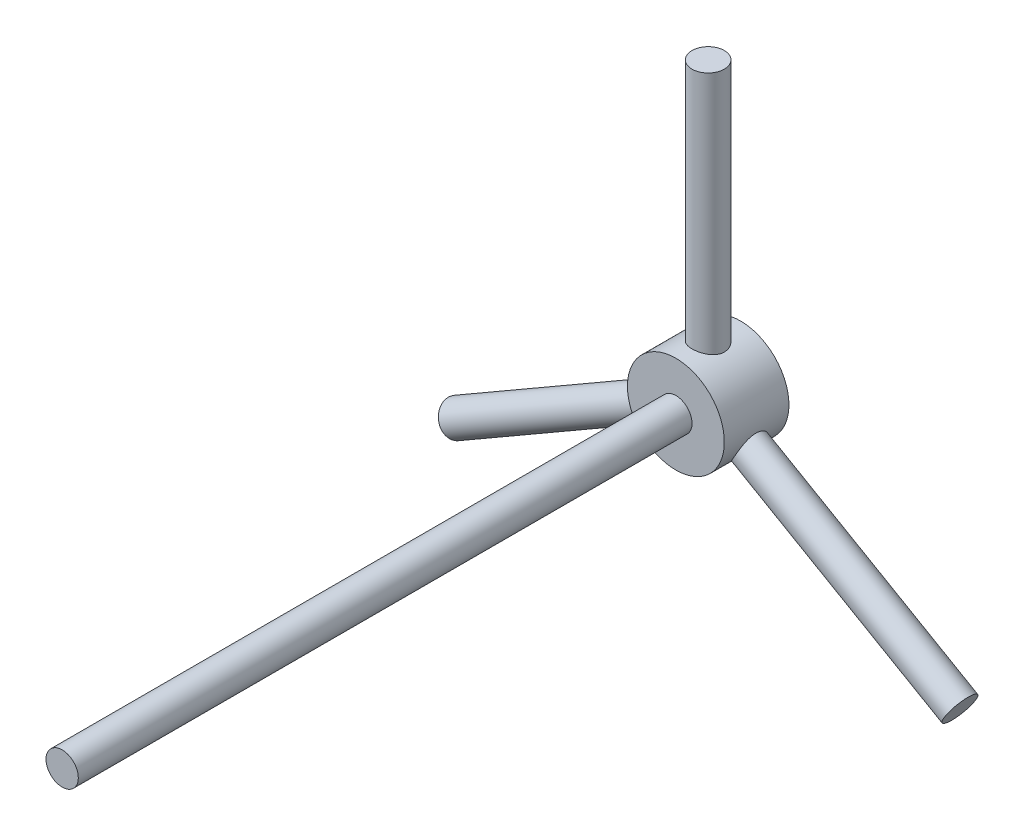
ISO-10303-21;
HEADER;
FILE_DESCRIPTION(('STEP AP214'),'2;1');
FILE_NAME('part.step','',(''),(''),'','','');
FILE_SCHEMA(('AUTOMOTIVE_DESIGN { 1 0 10303 214 1 1 1 1 }'));
ENDSEC;
DATA;
#1=APPLICATION_CONTEXT('core data for automotive mechanical design processes');
#2=APPLICATION_PROTOCOL_DEFINITION('international standard','automotive_design',2000,#1);
#3=PRODUCT_CONTEXT('',#1,'mechanical');
#4=PRODUCT('Part','Part','',(#3));
#5=PRODUCT_RELATED_PRODUCT_CATEGORY('part','',(#4));
#6=PRODUCT_DEFINITION_FORMATION('','',#4);
#7=PRODUCT_DEFINITION_CONTEXT('part definition',#1,'design');
#8=PRODUCT_DEFINITION('design','',#6,#7);
#9=PRODUCT_DEFINITION_SHAPE('','',#8);
#10=(LENGTH_UNIT() NAMED_UNIT(*) SI_UNIT(.MILLI.,.METRE.));
#11=(NAMED_UNIT(*) PLANE_ANGLE_UNIT() SI_UNIT($,.RADIAN.));
#12=(NAMED_UNIT(*) SI_UNIT($,.STERADIAN.) SOLID_ANGLE_UNIT());
#13=UNCERTAINTY_MEASURE_WITH_UNIT(LENGTH_MEASURE(1.E-05),#10,'distance_accuracy_value','');
#14=(GEOMETRIC_REPRESENTATION_CONTEXT(3) GLOBAL_UNCERTAINTY_ASSIGNED_CONTEXT((#13)) GLOBAL_UNIT_ASSIGNED_CONTEXT((#10,
#11,#12)) REPRESENTATION_CONTEXT('',''));
#15=CARTESIAN_POINT('',(0.,0.,0.));
#16=DIRECTION('',(0.,0.,1.));
#17=DIRECTION('',(1.,0.,0.));
#18=AXIS2_PLACEMENT_3D('',#15,#16,#17);
#19=CARTESIAN_POINT('',(0.,0.,-140.));
#20=DIRECTION('',(0.,0.,1.));
#21=DIRECTION('',(1.,0.,0.));
#22=AXIS2_PLACEMENT_3D('',#19,#20,#21);
#23=CYLINDRICAL_SURFACE('',#22,15.);
#24=CARTESIAN_POINT('',(0.,0.,-140.));
#25=DIRECTION('',(0.,0.,-1.));
#26=DIRECTION('',(-1.,0.,0.));
#27=AXIS2_PLACEMENT_3D('',#24,#25,#26);
#28=CIRCLE('',#27,15.);
#29=CARTESIAN_POINT('',(-15.,0.,-140.));
#30=VERTEX_POINT('',#29);
#31=EDGE_CURVE('E106',#30,#30,#28,.T.);
#32=ORIENTED_EDGE('',*,*,#31,.F.);
#33=EDGE_LOOP('',(#32));
#34=FACE_BOUND('',#33,.T.);
#35=CARTESIAN_POINT('',(0.,0.,-120.));
#36=DIRECTION('',(0.,0.,-1.));
#37=DIRECTION('',(-1.,0.,0.));
#38=AXIS2_PLACEMENT_3D('',#35,#36,#37);
#39=CIRCLE('',#38,15.);
#40=CARTESIAN_POINT('',(-15.,0.,-120.));
#41=VERTEX_POINT('',#40);
#42=EDGE_CURVE('E110',#41,#41,#39,.T.);
#43=ORIENTED_EDGE('',*,*,#42,.T.);
#44=EDGE_LOOP('',(#43));
#45=FACE_BOUND('',#44,.T.);
#46=CARTESIAN_POINT('',(0.,15.,-135.));
#47=CARTESIAN_POINT('',(-0.272816814433607,15.0000007650471,-135.000001268658));
#48=CARTESIAN_POINT('',(-0.545625972692718,14.9924884753769,-134.977598669364));
#49=CARTESIAN_POINT('',(-1.08320880436489,14.9632605101644,-134.888854455914));
#50=CARTESIAN_POINT('',(-1.3479816405942,14.941543360109,-134.822508280255));
#51=CARTESIAN_POINT('',(-1.86166394750877,14.8862653953208,-134.64840378308));
#52=CARTESIAN_POINT('',(-2.11059912942975,14.8527243865377,-134.540714687704));
#53=CARTESIAN_POINT('',(-2.58687468402703,14.7772222858721,-134.287294135808));
#54=CARTESIAN_POINT('',(-2.81421078479507,14.7352595334076,-134.141555174985));
#55=CARTESIAN_POINT('',(-3.24870837510974,14.6457047221309,-133.810870975708));
#56=CARTESIAN_POINT('',(-3.45501850148552,14.5979778231161,-133.624843828706));
#57=CARTESIAN_POINT('',(-3.83416346351645,14.5030157392292,-133.221164226459));
#58=CARTESIAN_POINT('',(-4.00699092746984,14.4557806648007,-133.003504825327));
#59=CARTESIAN_POINT('',(-4.319124711119,14.3656666235818,-132.535074424045));
#60=CARTESIAN_POINT('',(-4.45732429102253,14.3229519627198,-132.283531301449));
#61=CARTESIAN_POINT('',(-4.68909436930559,14.2487652698844,-131.759119527821));
#62=CARTESIAN_POINT('',(-4.78267848691248,14.2172898077928,-131.486257414221));
#63=CARTESIAN_POINT('',(-4.91936730756489,14.1705651637056,-130.936633892489));
#64=CARTESIAN_POINT('',(-4.96406724136037,14.1548047884338,-130.66031395754));
#65=CARTESIAN_POINT('',(-5.00670561667087,14.1397828315221,-130.103681229235));
#66=CARTESIAN_POINT('',(-5.00465850803659,14.1405161515599,-129.823369696484));
#67=CARTESIAN_POINT('',(-4.95509951850357,14.1579507500054,-129.280316847739));
#68=CARTESIAN_POINT('',(-4.90966956578089,14.1739207918415,-129.017357985281));
#69=CARTESIAN_POINT('',(-4.77803081419367,14.2188328846856,-128.503032901849));
#70=CARTESIAN_POINT('',(-4.69181713294739,14.2477764887883,-128.251668072798));
#71=CARTESIAN_POINT('',(-4.47969529031769,14.3158955569848,-127.76293625208));
#72=CARTESIAN_POINT('',(-4.35317024354078,14.3552282897692,-127.525859872662));
#73=CARTESIAN_POINT('',(-4.06444553151123,14.4396279286729,-127.075645458591));
#74=CARTESIAN_POINT('',(-3.90223556181879,14.4846964894921,-126.86251436533));
#75=CARTESIAN_POINT('',(-3.53674666341246,14.5783664584198,-126.454542009199));
#76=CARTESIAN_POINT('',(-3.3317657503819,14.6270294677509,-126.261236527455));
#77=CARTESIAN_POINT('',(-2.89169784984997,14.7203469193431,-125.911343666682));
#78=CARTESIAN_POINT('',(-2.65660797830397,14.765000976901,-125.754759809177));
#79=CARTESIAN_POINT('',(-2.15973806523143,14.8458553968921,-125.481518498825));
#80=CARTESIAN_POINT('',(-1.8977163820817,14.8819675004026,-125.365272543296));
#81=CARTESIAN_POINT('',(-1.35634541682251,14.9410283572211,-125.178984130221));
#82=CARTESIAN_POINT('',(-1.07700219077476,14.9639816827438,-125.108925622883));
#83=CARTESIAN_POINT('',(-0.521919147646528,14.9933813535722,-125.019721669888));
#84=CARTESIAN_POINT('',(-0.246547999324234,15.0005000916864,-124.998500954136));
#85=CARTESIAN_POINT('',(0.303875349801189,14.9994451347413,-125.001663367992));
#86=CARTESIAN_POINT('',(0.578927596598254,14.9912740209681,-125.026038799899));
#87=CARTESIAN_POINT('',(1.11259933152128,14.9610012358552,-125.11805953868));
#88=CARTESIAN_POINT('',(1.37146403417422,14.9393099355596,-125.184431030247));
#89=CARTESIAN_POINT('',(1.87427979289787,14.8845923415035,-125.356967222334));
#90=CARTESIAN_POINT('',(2.11822894254304,14.8515646023338,-125.463136997339));
#91=CARTESIAN_POINT('',(2.59144148196637,14.7764465643645,-125.715352159204));
#92=CARTESIAN_POINT('',(2.82014979608573,14.7341407377893,-125.862372966416));
#93=CARTESIAN_POINT('',(3.25032415067792,14.6452626958131,-126.190970750067));
#94=CARTESIAN_POINT('',(3.45178183897788,14.5986891796914,-126.372558280159));
#95=CARTESIAN_POINT('',(3.8312625390315,14.5038423990222,-126.774893755033));
#96=CARTESIAN_POINT('',(4.00780484622885,14.4555880543714,-126.997046134634));
#97=CARTESIAN_POINT('',(4.32128761161786,14.3649986647354,-127.468857839054));
#98=CARTESIAN_POINT('',(4.45822773965506,14.3226636691001,-127.71851739317));
#99=CARTESIAN_POINT('',(4.6879846520818,14.2491195895692,-128.238365076449));
#100=CARTESIAN_POINT('',(4.7808906608251,14.2178880396489,-128.508510395844));
#101=CARTESIAN_POINT('',(4.91947333379678,14.1705416153225,-129.061893250221));
#102=CARTESIAN_POINT('',(4.9651712747697,14.154419931182,-129.345124827022));
#103=CARTESIAN_POINT('',(5.00638141238671,14.1398929437089,-129.900985480205));
#104=CARTESIAN_POINT('',(5.004351286542,14.1406200128708,-130.173411701434));
#105=CARTESIAN_POINT('',(4.95621146724347,14.1575634911934,-130.71382537461));
#106=CARTESIAN_POINT('',(4.91010439729293,14.1737789784681,-130.981813089775));
#107=CARTESIAN_POINT('',(4.77685906564673,14.2192262152446,-131.500678315012));
#108=CARTESIAN_POINT('',(4.69051673007757,14.2482049011239,-131.751784125022));
#109=CARTESIAN_POINT('',(4.47989682879873,14.3158199409234,-132.236137034691));
#110=CARTESIAN_POINT('',(4.35561084276902,14.3544584381697,-132.46938015594));
#111=CARTESIAN_POINT('',(4.06630346291715,14.4391414613023,-132.922418349615));
#112=CARTESIAN_POINT('',(3.8997412138229,14.4854355821069,-133.141182509492));
#113=CARTESIAN_POINT('',(3.53321441567824,14.5791678141626,-133.548449066921));
#114=CARTESIAN_POINT('',(3.33324042225741,14.6266062456186,-133.73694287844));
#115=CARTESIAN_POINT('',(2.89620778460345,14.7195015262772,-134.085722061446));
#116=CARTESIAN_POINT('',(2.65800756749865,14.7648090900628,-134.244621738755));
#117=CARTESIAN_POINT('',(2.15678678703313,14.8462995586306,-134.519952144253));
#118=CARTESIAN_POINT('',(1.89377259066174,14.8824847953965,-134.63639372961));
#119=CARTESIAN_POINT('',(1.36246823600487,14.9402757534271,-134.818608162443));
#120=CARTESIAN_POINT('',(1.09493878838204,14.9624606211261,-134.886412331317));
#121=CARTESIAN_POINT('',(0.551602080051229,14.9923203532111,-134.977101403386));
#122=CARTESIAN_POINT('',(0.275797127843722,14.9999992265954,-134.999998717483));
#123=CARTESIAN_POINT('',(0.,15.,-135.));
#124=B_SPLINE_CURVE_WITH_KNOTS('',3,(#46,#47,#48,#49,#50,#51,#52,#53,#54,#55,#56,#57,#58,#59,
#60,#61,#62,#63,#64,#65,#66,#67,#68,#69,#70,#71,#72,#73,#74,#75,#76,#77,#78,#79,#80,#81,#82,#83,
#84,#85,#86,#87,#88,#89,#90,#91,#92,#93,#94,#95,#96,#97,#98,#99,#100,#101,#102,#103,#104,#105,
#106,#107,#108,#109,#110,#111,#112,#113,#114,#115,#116,#117,#118,#119,#120,#121,#122,#123),
.UNSPECIFIED.,.T.,.F.,(4,2,2,2,2,2,2,2,2,2,2,2,2,2,2,2,2,2,2,2,2,2,2,2,2,2,2,2,2,2,2,2,2,2,2,2,
2,2,4),(0.,0.817435530130051,1.63495592633761,2.45111336435137,3.26743188899549,
4.10923421413779,4.95122166437652,5.81741924118925,6.6833522346775,7.52009628712783,
8.35658169941008,9.15484132763714,9.95319654288063,10.764408557863,11.5758551280169,
12.4296652906749,13.2835572984374,14.1459202826244,15.0079834439669,15.832679158865,
16.6572356583153,17.4579078990172,18.2586822643117,19.0805199922933,19.9026090412011,
20.7620511441441,21.6215004118563,22.479200691445,23.3365142353985,24.1497833033194,
24.9630039676753,25.7607793541274,26.5587319089054,27.3915033346968,28.2245105562954,
29.0899830418615,29.9552340577293,30.7818279187972,31.6081933020135),.UNSPECIFIED.);
#125=CARTESIAN_POINT('',(0.,15.,-135.));
#126=VERTEX_POINT('',#125);
#127=EDGE_CURVE('E54',#126,#126,#124,.T.);
#128=ORIENTED_EDGE('',*,*,#127,.F.);
#129=EDGE_LOOP('',(#128));
#130=FACE_BOUND('',#129,.T.);
#131=CARTESIAN_POINT('',(9.74744871391585,-11.4011948307877,-130.));
#132=CARTESIAN_POINT('',(9.74744729204055,-11.4011954991294,-130.27234087418));
#133=CARTESIAN_POINT('',(9.76549911687741,-11.385836297385,-130.544673999118));
#134=CARTESIAN_POINT('',(9.836373376482,-11.3246589578408,-131.081272104971));
#135=CARTESIAN_POINT('',(9.88920153881731,-11.2788358026989,-131.345535749362));
#136=CARTESIAN_POINT('',(10.0258547993025,-11.157530467179,-131.858134464986));
#137=CARTESIAN_POINT('',(10.1096191370544,-11.0821064065834,-132.106499647214));
#138=CARTESIAN_POINT('',(10.3030570648259,-10.9024938914726,-132.58180024274));
#139=CARTESIAN_POINT('',(10.4127363708872,-10.7982990901642,-132.808730912768));
#140=CARTESIAN_POINT('',(10.6564300763415,-10.5579706212188,-133.243599811692));
#141=CARTESIAN_POINT('',(10.7911704668704,-10.4208339627081,-133.450577143359));
#142=CARTESIAN_POINT('',(11.0754033609003,-10.1182251447018,-133.831034006123));
#143=CARTESIAN_POINT('',(11.2248982275841,-9.95274844293069,-134.004508157912));
#144=CARTESIAN_POINT('',(11.5357747803679,-9.59083866791103,-134.317394486648));
#145=CARTESIAN_POINT('',(11.6973648391181,-9.39371055413828,-134.45579985309));
#146=CARTESIAN_POINT('',(12.0213835274724,-8.9753116302445,-134.687957925638));
#147=CARTESIAN_POINT('',(12.1838119191314,-8.75404734650128,-134.781722665885));
#148=CARTESIAN_POINT('',(12.4968862923078,-8.3006655485025,-134.918679273162));
#149=CARTESIAN_POINT('',(12.6477455912463,-8.0691935125121,-134.963517231285));
#150=CARTESIAN_POINT('',(12.9380246609471,-7.59504475948524,-135.006581466803));
#151=CARTESIAN_POINT('',(13.0774473709283,-7.35237094653363,-135.004819758262));
#152=CARTESIAN_POINT('',(13.3354109868568,-6.87299459282486,-134.95577872717));
#153=CARTESIAN_POINT('',(13.4545564251917,-6.63643115377736,-134.910287357628));
#154=CARTESIAN_POINT('',(13.6760714940059,-6.1670460584105,-134.778035095098));
#155=CARTESIAN_POINT('',(13.7784399868859,-5.93422465679322,-134.691271405101));
#156=CARTESIAN_POINT('',(13.9668145450403,-5.4763346174206,-134.47789341347));
#157=CARTESIAN_POINT('',(14.052587857999,-5.25140810452179,-134.350770307267));
#158=CARTESIAN_POINT('',(14.2065729962428,-4.81933307296342,-134.060701472757));
#159=CARTESIAN_POINT('',(14.2747799267855,-4.6121895200898,-133.897745783362));
#160=CARTESIAN_POINT('',(14.3978405415018,-4.21282784783359,-133.531628032701));
#161=CARTESIAN_POINT('',(14.4519143403639,-4.02177161274428,-133.326934210793));
#162=CARTESIAN_POINT('',(14.544489402007,-3.67293891046693,-132.887756371367));
#163=CARTESIAN_POINT('',(14.582988265516,-3.51516757250705,-132.65326777136));
#164=CARTESIAN_POINT('',(14.6471857390312,-3.2373826242109,-132.156731871983));
#165=CARTESIAN_POINT('',(14.6726940388161,-3.11793936933234,-131.894339343411));
#166=CARTESIAN_POINT('',(14.7122043013202,-2.92587974121855,-131.352143028928));
#167=CARTESIAN_POINT('',(14.72621108695,-2.85324374312775,-131.072346593969));
#168=CARTESIAN_POINT('',(14.7437808953927,-2.76098602507505,-130.516808222942));
#169=CARTESIAN_POINT('',(14.7477865886465,-2.739120361157,-130.241452876257));
#170=CARTESIAN_POINT('',(14.7470667789332,-2.74299828219513,-129.69111925443));
#171=CARTESIAN_POINT('',(14.7423428618034,-2.76873321993771,-129.41614091988));
#172=CARTESIAN_POINT('',(14.723992111363,-2.86465938190599,-128.88421517144));
#173=CARTESIAN_POINT('',(14.7106766745469,-2.9332931300505,-128.626972849246));
#174=CARTESIAN_POINT('',(14.6742753753987,-3.11026485265499,-128.127281968804));
#175=CARTESIAN_POINT('',(14.6511877808815,-3.21860986576499,-127.884836042046));
#176=CARTESIAN_POINT('',(14.5926658271802,-3.47444912902858,-127.413097895765));
#177=CARTESIAN_POINT('',(14.5568630828251,-3.62307610828602,-127.184466786791));
#178=CARTESIAN_POINT('',(14.4710104278767,-3.9520515751551,-126.754269738081));
#179=CARTESIAN_POINT('',(14.4209563152744,-4.1324094125929,-126.552711806694));
#180=CARTESIAN_POINT('',(14.3017865969098,-4.52808283892955,-126.172360079547));
#181=CARTESIAN_POINT('',(14.2318697752126,-4.74466282041755,-125.995128049906));
#182=CARTESIAN_POINT('',(14.0724165324078,-5.19854474190837,-125.68041928826));
#183=CARTESIAN_POINT('',(13.9828808083666,-5.43584594549879,-125.542941144188));
#184=CARTESIAN_POINT('',(13.7841868988566,-5.9215285312154,-125.312899475691));
#185=CARTESIAN_POINT('',(13.6751630339612,-6.1698258238446,-125.22004361426));
#186=CARTESIAN_POINT('',(13.4380843829905,-6.67041617603996,-125.081361289699));
#187=CARTESIAN_POINT('',(13.310036485543,-6.92270775984583,-125.035517850598));
#188=CARTESIAN_POINT('',(13.0442321277208,-7.41091353269097,-124.993689611972));
#189=CARTESIAN_POINT('',(12.9072148248434,-7.64704014810894,-124.995462730338));
#190=CARTESIAN_POINT('',(12.6226409379912,-8.10816422164023,-125.043286540732));
#191=CARTESIAN_POINT('',(12.4750852099091,-8.3331625810439,-125.089333640764));
#192=CARTESIAN_POINT('',(12.1770955223983,-8.7627433620278,-125.22291117288));
#193=CARTESIAN_POINT('',(12.0267445074192,-8.96759329961488,-125.309771076765));
#194=CARTESIAN_POINT('',(11.726552017287,-9.35673217890904,-125.521887655486));
#195=CARTESIAN_POINT('',(11.5767106392672,-9.54101739306771,-125.647151275985));
#196=CARTESIAN_POINT('',(11.2780008528102,-9.89251639791566,-125.93784756051));
#197=CARTESIAN_POINT('',(11.1293729662036,-10.0588478153445,-126.104593426908));
#198=CARTESIAN_POINT('',(10.8455641002599,-10.3642308207927,-126.471286955781));
#199=CARTESIAN_POINT('',(10.7103874332433,-10.5032736741851,-126.671245211314));
#200=CARTESIAN_POINT('',(10.4551321513524,-10.7575078965706,-127.108046777935));
#201=CARTESIAN_POINT('',(10.3358516882737,-10.8715525352763,-127.346027554883));
#202=CARTESIAN_POINT('',(10.1259838632081,-11.0673008046025,-127.846672134514));
#203=CARTESIAN_POINT('',(10.0353890047897,-11.1490128861111,-128.109329465148));
#204=CARTESIAN_POINT('',(9.89233906308427,-11.2760995576912,-128.639809120078));
#205=CARTESIAN_POINT('',(9.83834509949577,-11.3229497109952,-128.906861317627));
#206=CARTESIAN_POINT('',(9.76590677727584,-11.3854916337288,-129.449280252334));
#207=CARTESIAN_POINT('',(9.74745015153247,-11.4011941550469,-129.724644087054));
#208=CARTESIAN_POINT('',(9.74744871391585,-11.4011948307877,-130.));
#209=B_SPLINE_CURVE_WITH_KNOTS('',3,(#131,#132,#133,#134,#135,#136,#137,#138,#139,#140,#141,
#142,#143,#144,#145,#146,#147,#148,#149,#150,#151,#152,#153,#154,#155,#156,#157,#158,#159,#160,
#161,#162,#163,#164,#165,#166,#167,#168,#169,#170,#171,#172,#173,#174,#175,#176,#177,#178,#179,
#180,#181,#182,#183,#184,#185,#186,#187,#188,#189,#190,#191,#192,#193,#194,#195,#196,#197,#198,
#199,#200,#201,#202,#203,#204,#205,#206,#207,#208),.UNSPECIFIED.,.T.,.F.,(4,2,2,2,2,2,2,2,2,2,2,
2,2,2,2,2,2,2,2,2,2,2,2,2,2,2,2,2,2,2,2,2,2,2,2,2,2,2,4),(0.,0.816002923996751,1.63214027507581,
2.44668313750409,3.26140583092719,4.10506687137836,4.94886325859937,5.81467530718281,
6.68025381933942,7.51571593824669,8.35096266511635,9.15345024127843,9.95599220946182,
10.7690827430167,11.5823995937011,12.4340087181959,13.2857489806053,14.1496319921527,
15.0131525678307,15.8377145682219,16.6621267918616,17.4582197884388,18.2544539573472,
19.0759428867857,19.8976742831063,20.7589404085546,21.6201759378766,22.4756895595425,
23.3308941502078,24.1459042338817,24.960848200489,25.7628478020214,26.5649925381621,
27.3967759760316,28.2288252216315,29.0934451368072,29.9578389133432,30.7831606081345,
31.6081973595231),.UNSPECIFIED.);
#210=CARTESIAN_POINT('',(9.74744871391585,-11.4011948307877,-130.));
#211=VERTEX_POINT('',#210);
#212=EDGE_CURVE('E50',#211,#211,#209,.T.);
#213=ORIENTED_EDGE('',*,*,#212,.F.);
#214=EDGE_LOOP('',(#213));
#215=FACE_BOUND('',#214,.T.);
#216=CARTESIAN_POINT('',(-14.7474487139159,-2.74094079294336,-130.));
#217=CARTESIAN_POINT('',(-14.7474485817791,-2.74093922739237,-130.27234087418));
#218=CARTESIAN_POINT('',(-14.7431730353051,-2.76425216715797,-130.544673999118));
#219=CARTESIAN_POINT('',(-14.7256290349261,-2.8562197462221,-131.081272104971));
#220=CARTESIAN_POINT('',(-14.7123590996593,-2.92488185441065,-131.345535749362));
#221=CARTESIAN_POINT('',(-14.675632227727,-3.10387971726076,-131.858134464986));
#222=CARTESIAN_POINT('',(-14.6521952440706,-3.21413379198285,-132.106499647214));
#223=CARTESIAN_POINT('',(-14.5933652070328,-3.47146220904379,-132.58180024274));
#224=CARTESIAN_POINT('',(-14.5579695151881,-3.61854467501655,-132.808730912768));
#225=CARTESIAN_POINT('',(-14.4716858085559,-3.94975384915504,-133.243599811692));
#226=CARTESIAN_POINT('',(-14.42029217376,-4.13501077952423,-133.450577143359));
#227=CARTESIAN_POINT('',(-14.3003416969723,-4.53246809534849,-133.831034006123));
#228=CARTESIAN_POINT('',(-14.231782102846,-4.74467279851752,-134.004508157912));
#229=CARTESIAN_POINT('',(-14.0737973201929,-5.19485467817904,-134.317394486648));
#230=CARTESIAN_POINT('',(-13.9838743952407,-5.43335983094212,-134.45579985309));
#231=CARTESIAN_POINT('',(-13.7835396424098,-5.92316770830477,-134.687957925638));
#232=CARTESIAN_POINT('',(-13.6731333475675,-6.17446696364894,-134.781722665885));
#233=CARTESIAN_POINT('',(-13.4370303794753,-6.67228822309295,-134.918679273162));
#234=CARTESIAN_POINT('',(-13.3119993655111,-6.91867222636598,-134.963517231285));
#235=CARTESIAN_POINT('',(-13.0465140350676,-7.40713565142727,-135.006581466803));
#236=CARTESIAN_POINT('',(-12.9060637032089,-7.64921616661127,-135.004819758262));
#237=CARTESIAN_POINT('',(-12.6198934108878,-8.11230738811182,-134.95577872717));
#238=CARTESIAN_POINT('',(-12.4745961822335,-8.33377208397863,-134.910287357628));
#239=CARTESIAN_POINT('',(-12.1788542998951,-8.7603023085762,-134.778035095098));
#240=CARTESIAN_POINT('',(-12.0284092979898,-8.96536672476598,-134.691271405101));
#241=CARTESIAN_POINT('',(-11.7260521708305,-9.35744889724073,-134.47789341347));
#242=CARTESIAN_POINT('',(-11.5741467531548,-9.54419402167911,-134.350770307267));
#243=CARTESIAN_POINT('',(-11.2769513686061,-9.89358657898264,-134.060701472757));
#244=CARTESIAN_POINT('',(-11.1316632548588,-10.0562272899836,-133.897745783362));
#245=CARTESIAN_POINT('',(-10.8473362087452,-10.3624817446613,-133.531628032702));
#246=CARTESIAN_POINT('',(-10.7089135550375,-10.5048391456997,-133.326934210793));
#247=CARTESIAN_POINT('',(-10.4531031040161,-10.7594278519782,-132.887756371367));
#248=CARTESIAN_POINT('',(-10.3357185491083,-10.8716545147738,-132.65326777136));
#249=CARTESIAN_POINT('',(-10.1272484638525,-11.0661436318448,-132.156731871983));
#250=CARTESIAN_POINT('',(-10.0365617207094,-11.1479560949052,-131.894339343411));
#251=CARTESIAN_POINT('',(-9.88998833497349,-11.2782028000008,-131.352143028928));
#252=CARTESIAN_POINT('',(-9.83408710821254,-11.326651031227,-131.072346593969));
#253=CARTESIAN_POINT('',(-9.76297448490505,-11.3879957907043,-130.516808222942));
#254=CARTESIAN_POINT('',(-9.74604111110831,-11.4023976547809,-130.241452876257));
#255=CARTESIAN_POINT('',(-9.74903958438453,-11.3998353207642,-129.69111925443));
#256=CARTESIAN_POINT('',(-9.76896473566952,-11.3828768196531,-129.41614091988));
#257=CARTESIAN_POINT('',(-9.84286385360138,-11.3190215226091,-128.88421517144));
#258=CARTESIAN_POINT('',(-9.89564470464343,-11.2731731419916,-128.626972849246));
#259=CARTESIAN_POINT('',(-10.0307060625963,-11.1531628308963,-128.127281968804));
#260=CARTESIAN_POINT('',(-10.1129917990643,-11.0789958809771,-127.884836042046));
#261=CARTESIAN_POINT('',(-10.3052941234854,-10.9003947507609,-127.413097895765));
#262=CARTESIAN_POINT('',(-10.4161074910326,-10.7950751749955,-127.184466786791));
#263=CARTESIAN_POINT('',(-10.6580822750889,-10.5562368613933,-126.754269738081));
#264=CARTESIAN_POINT('',(-10.7892496877805,-10.4227098095969,-126.552711806694));
#265=CARTESIAN_POINT('',(-11.0723280674082,-10.121669092963,-126.172360079547));
#266=CARTESIAN_POINT('',(-11.2249334224793,-9.95282935847739,-125.995128049906));
#267=CARTESIAN_POINT('',(-11.5382800754065,-9.58779783874717,-125.68041928826));
#268=CARTESIAN_POINT('',(-11.6990210840438,-9.39160702538606,-125.542941144188));
#269=CARTESIAN_POINT('',(-12.0202875866951,-8.97669175931487,-125.312899475691));
#270=CARTESIAN_POINT('',(-12.1808074173552,-8.75812567638208,-125.22004361426));
#271=CARTESIAN_POINT('',(-12.4957920537605,-8.30251436584888,-125.081361289699));
#272=CARTESIAN_POINT('',(-12.6502590257736,-8.06547584185524,-125.035517850598));
#273=CARTESIAN_POINT('',(-12.9401554484206,-7.59117962912197,-124.993689611972));
#274=CARTESIAN_POINT('',(-13.0761384444435,-7.35445585636314,-124.995462730338));
#275=CARTESIAN_POINT('',(-13.333196662992,-6.87744560432979,-125.043286540732));
#276=CARTESIAN_POINT('',(-13.4542730940044,-6.63715941563501,-125.089333640764));
#277=CARTESIAN_POINT('',(-13.6773061195586,-6.16430238569293,-125.22291117288));
#278=CARTESIAN_POINT('',(-13.7795358619831,-5.93166961844266,-125.309771076765));
#279=CARTESIAN_POINT('',(-13.966443771986,-5.47712585631582,-125.521887655486));
#280=CARTESIAN_POINT('',(-14.0511187599793,-5.25521680933324,-125.647151275985));
#281=CARTESIAN_POINT('',(-14.2061709343541,-4.82077704347851,-125.93784756051));
#282=CARTESIAN_POINT('',(-14.2759042239917,-4.608895809252,-126.104593426908));
#283=CARTESIAN_POINT('',(-14.3984692316221,-4.21041861880137,-126.471286955781));
#284=CARTESIAN_POINT('',(-14.4512955413662,-4.02383076446984,-126.671245211314));
#285=CARTESIAN_POINT('',(-14.543841195518,-3.67565609470945,-127.108046777935));
#286=CARTESIAN_POINT('',(-14.5829665182633,-3.5153338641553,-127.346027554883));
#287=CARTESIAN_POINT('',(-14.6475555797137,-3.23570886154842,-127.846672134514));
#288=CARTESIAN_POINT('',(-14.6730228888871,-3.1163953719515,-128.109329465148));
#289=CARTESIAN_POINT('',(-14.7115582041051,-2.9289671526347,-128.639809120078));
#290=CARTESIAN_POINT('',(-14.7251346452434,-2.85878193186401,-128.906861317627));
#291=CARTESIAN_POINT('',(-14.7430783780222,-2.76477754324725,-129.449280252334));
#292=CARTESIAN_POINT('',(-14.7474488475155,-2.74094237582629,-129.724644087054));
#293=CARTESIAN_POINT('',(-14.7474487139159,-2.74094079294336,-130.));
#294=B_SPLINE_CURVE_WITH_KNOTS('',3,(#216,#217,#218,#219,#220,#221,#222,#223,#224,#225,#226,
#227,#228,#229,#230,#231,#232,#233,#234,#235,#236,#237,#238,#239,#240,#241,#242,#243,#244,#245,
#246,#247,#248,#249,#250,#251,#252,#253,#254,#255,#256,#257,#258,#259,#260,#261,#262,#263,#264,
#265,#266,#267,#268,#269,#270,#271,#272,#273,#274,#275,#276,#277,#278,#279,#280,#281,#282,#283,
#284,#285,#286,#287,#288,#289,#290,#291,#292,#293),.UNSPECIFIED.,.T.,.F.,(4,2,2,2,2,2,2,2,2,2,2,
2,2,2,2,2,2,2,2,2,2,2,2,2,2,2,2,2,2,2,2,2,2,2,2,2,2,2,4),(0.,0.816002923996752,1.63214027507582,
2.44668313750415,3.26140583092719,4.10506687137837,4.94886325859937,5.81467530718284,
6.68025381933942,7.51571593824669,8.35096266511635,9.15345024127843,9.95599220946181,
10.7690827430167,11.5823995937011,12.4340087181959,13.2857489806053,14.1496319921527,
15.0131525678307,15.8377145682219,16.6621267918616,17.4582197884388,18.2544539573472,
19.0759428867857,19.8976742831063,20.7589404085546,21.6201759378766,22.4756895595425,
23.3308941502078,24.1459042338817,24.960848200489,25.7628478020214,26.5649925381621,
27.3967759760316,28.2288252216315,29.0934451368072,29.9578389133432,30.7831606081345,
31.6081973595231),.UNSPECIFIED.);
#295=CARTESIAN_POINT('',(-14.7474487139159,-2.74094079294336,-130.));
#296=VERTEX_POINT('',#295);
#297=EDGE_CURVE('E10',#296,#296,#294,.T.);
#298=ORIENTED_EDGE('',*,*,#297,.F.);
#299=EDGE_LOOP('',(#298));
#300=FACE_BOUND('',#299,.T.);
#301=ADVANCED_FACE('F39',(#34,#45,#130,#215,#300),#23,.T.);
#302=CARTESIAN_POINT('',(0.,0.,70.));
#303=DIRECTION('',(0.,0.,-1.));
#304=DIRECTION('',(-1.,0.,0.));
#305=AXIS2_PLACEMENT_3D('',#302,#303,#304);
#306=CYLINDRICAL_SURFACE('',#305,5.);
#307=CARTESIAN_POINT('',(0.,0.,70.));
#308=DIRECTION('',(0.,0.,1.));
#309=DIRECTION('',(1.,0.,0.));
#310=AXIS2_PLACEMENT_3D('',#307,#308,#309);
#311=CIRCLE('',#310,5.);
#312=CARTESIAN_POINT('',(5.,0.,70.));
#313=VERTEX_POINT('',#312);
#314=EDGE_CURVE('E58',#313,#313,#311,.T.);
#315=ORIENTED_EDGE('',*,*,#314,.F.);
#316=EDGE_LOOP('',(#315));
#317=FACE_BOUND('',#316,.T.);
#318=CARTESIAN_POINT('',(0.,0.,-120.));
#319=DIRECTION('',(0.,0.,-1.));
#320=DIRECTION('',(-1.,0.,0.));
#321=AXIS2_PLACEMENT_3D('',#318,#319,#320);
#322=CIRCLE('',#321,5.);
#323=CARTESIAN_POINT('',(-5.,0.,-120.));
#324=VERTEX_POINT('',#323);
#325=EDGE_CURVE('E117',#324,#324,#322,.T.);
#326=ORIENTED_EDGE('',*,*,#325,.F.);
#327=EDGE_LOOP('',(#326));
#328=FACE_BOUND('',#327,.T.);
#329=ADVANCED_FACE('F41',(#317,#328),#306,.T.);
#330=CARTESIAN_POINT('',(0.,0.,70.));
#331=DIRECTION('',(0.,0.,1.));
#332=DIRECTION('',(1.,0.,0.));
#333=AXIS2_PLACEMENT_3D('',#330,#331,#332);
#334=PLANE('',#333);
#335=ORIENTED_EDGE('',*,*,#314,.T.);
#336=EDGE_LOOP('',(#335));
#337=FACE_BOUND('',#336,.T.);
#338=ADVANCED_FACE('F87',(#337),#334,.T.);
#339=CARTESIAN_POINT('',(0.,0.,-140.));
#340=DIRECTION('',(0.,0.,-1.));
#341=DIRECTION('',(-1.,0.,0.));
#342=AXIS2_PLACEMENT_3D('',#339,#340,#341);
#343=PLANE('',#342);
#344=ORIENTED_EDGE('',*,*,#31,.T.);
#345=EDGE_LOOP('',(#344));
#346=FACE_BOUND('',#345,.T.);
#347=ADVANCED_FACE('F85',(#346),#343,.T.);
#348=CARTESIAN_POINT('',(0.,0.,-120.));
#349=DIRECTION('',(0.,0.,-1.));
#350=DIRECTION('',(-1.,0.,0.));
#351=AXIS2_PLACEMENT_3D('',#348,#349,#350);
#352=PLANE('',#351);
#353=ORIENTED_EDGE('',*,*,#325,.T.);
#354=EDGE_LOOP('',(#353));
#355=FACE_BOUND('',#354,.T.);
#356=ORIENTED_EDGE('',*,*,#42,.F.);
#357=EDGE_LOOP('',(#356));
#358=FACE_BOUND('',#357,.T.);
#359=ADVANCED_FACE('F83',(#355,#358),#352,.F.);
#360=CARTESIAN_POINT('',(0.,90.,-130.));
#361=DIRECTION('',(0.,-1.,0.));
#362=DIRECTION('',(0.,0.,-1.));
#363=AXIS2_PLACEMENT_3D('',#360,#361,#362);
#364=CYLINDRICAL_SURFACE('',#363,5.);
#365=CARTESIAN_POINT('',(0.,90.,-130.));
#366=DIRECTION('',(0.,1.,0.));
#367=DIRECTION('',(0.,0.,1.));
#368=AXIS2_PLACEMENT_3D('',#365,#366,#367);
#369=CIRCLE('',#368,5.);
#370=CARTESIAN_POINT('',(0.,90.,-125.));
#371=VERTEX_POINT('',#370);
#372=EDGE_CURVE('E115',#371,#371,#369,.T.);
#373=ORIENTED_EDGE('',*,*,#372,.F.);
#374=EDGE_LOOP('',(#373));
#375=FACE_BOUND('',#374,.T.);
#376=ORIENTED_EDGE('',*,*,#127,.T.);
#377=EDGE_LOOP('',(#376));
#378=FACE_BOUND('',#377,.T.);
#379=ADVANCED_FACE('F78',(#375,#378),#364,.T.);
#380=CARTESIAN_POINT('',(0.,90.,-130.));
#381=DIRECTION('',(0.,1.,0.));
#382=DIRECTION('',(0.,0.,1.));
#383=AXIS2_PLACEMENT_3D('',#380,#381,#382);
#384=PLANE('',#383);
#385=ORIENTED_EDGE('',*,*,#372,.T.);
#386=EDGE_LOOP('',(#385));
#387=FACE_BOUND('',#386,.T.);
#388=ADVANCED_FACE('F75',(#387),#384,.T.);
#389=CARTESIAN_POINT('',(77.9422863405993,-45.0000000000004,-130.));
#390=DIRECTION('',(-0.866025403784436,0.500000000000004,0.));
#391=DIRECTION('',(-0.500000000000004,-0.866025403784436,0.));
#392=AXIS2_PLACEMENT_3D('',#389,#390,#391);
#393=CYLINDRICAL_SURFACE('',#392,4.99999999999999);
#394=CARTESIAN_POINT('',(77.9422863405993,-45.0000000000004,-130.));
#395=DIRECTION('',(0.866025403784436,-0.500000000000004,0.));
#396=DIRECTION('',(0.500000000000004,0.866025403784436,0.));
#397=AXIS2_PLACEMENT_3D('',#394,#395,#396);
#398=CIRCLE('',#397,4.99999999999999);
#399=CARTESIAN_POINT('',(80.4422863405993,-40.6698729810782,-130.));
#400=VERTEX_POINT('',#399);
#401=EDGE_CURVE('E120',#400,#400,#398,.T.);
#402=ORIENTED_EDGE('',*,*,#401,.F.);
#403=EDGE_LOOP('',(#402));
#404=FACE_BOUND('',#403,.T.);
#405=ORIENTED_EDGE('',*,*,#212,.T.);
#406=EDGE_LOOP('',(#405));
#407=FACE_BOUND('',#406,.T.);
#408=ADVANCED_FACE('F69',(#404,#407),#393,.T.);
#409=CARTESIAN_POINT('',(77.9422863405993,-45.0000000000004,-130.));
#410=DIRECTION('',(0.866025403784436,-0.500000000000004,0.));
#411=DIRECTION('',(0.500000000000004,0.866025403784436,0.));
#412=AXIS2_PLACEMENT_3D('',#409,#410,#411);
#413=PLANE('',#412);
#414=ORIENTED_EDGE('',*,*,#401,.T.);
#415=EDGE_LOOP('',(#414));
#416=FACE_BOUND('',#415,.T.);
#417=ADVANCED_FACE('F74',(#416),#413,.T.);
#418=CARTESIAN_POINT('',(-77.9422863405993,-45.0000000000004,-130.));
#419=DIRECTION('',(0.866025403784436,0.500000000000004,0.));
#420=DIRECTION('',(-0.500000000000004,0.866025403784436,0.));
#421=AXIS2_PLACEMENT_3D('',#418,#419,#420);
#422=CYLINDRICAL_SURFACE('',#421,4.99999999999999);
#423=CARTESIAN_POINT('',(-77.9422863405993,-45.0000000000004,-130.));
#424=DIRECTION('',(-0.866025403784436,-0.500000000000004,0.));
#425=DIRECTION('',(0.500000000000004,-0.866025403784436,0.));
#426=AXIS2_PLACEMENT_3D('',#423,#424,#425);
#427=CIRCLE('',#426,4.99999999999999);
#428=CARTESIAN_POINT('',(-75.4422863405993,-49.3301270189225,-130.));
#429=VERTEX_POINT('',#428);
#430=EDGE_CURVE('E199',#429,#429,#427,.T.);
#431=ORIENTED_EDGE('',*,*,#430,.F.);
#432=EDGE_LOOP('',(#431));
#433=FACE_BOUND('',#432,.T.);
#434=ORIENTED_EDGE('',*,*,#297,.T.);
#435=EDGE_LOOP('',(#434));
#436=FACE_BOUND('',#435,.T.);
#437=ADVANCED_FACE('F170',(#433,#436),#422,.T.);
#438=CARTESIAN_POINT('',(-77.9422863405993,-45.0000000000004,-130.));
#439=DIRECTION('',(-0.866025403784436,-0.500000000000004,0.));
#440=DIRECTION('',(0.500000000000004,-0.866025403784436,0.));
#441=AXIS2_PLACEMENT_3D('',#438,#439,#440);
#442=PLANE('',#441);
#443=ORIENTED_EDGE('',*,*,#430,.T.);
#444=EDGE_LOOP('',(#443));
#445=FACE_BOUND('',#444,.T.);
#446=ADVANCED_FACE('F179',(#445),#442,.T.);
#447=CLOSED_SHELL('',(#301,#329,#338,#347,#359,#379,#388,#408,#417,#437,#446));
#448=MANIFOLD_SOLID_BREP('B2',#447);
#449=ADVANCED_BREP_SHAPE_REPRESENTATION('',(#18,#448),#14);
#450=SHAPE_DEFINITION_REPRESENTATION(#9,#449);
ENDSEC;
END-ISO-10303-21;
